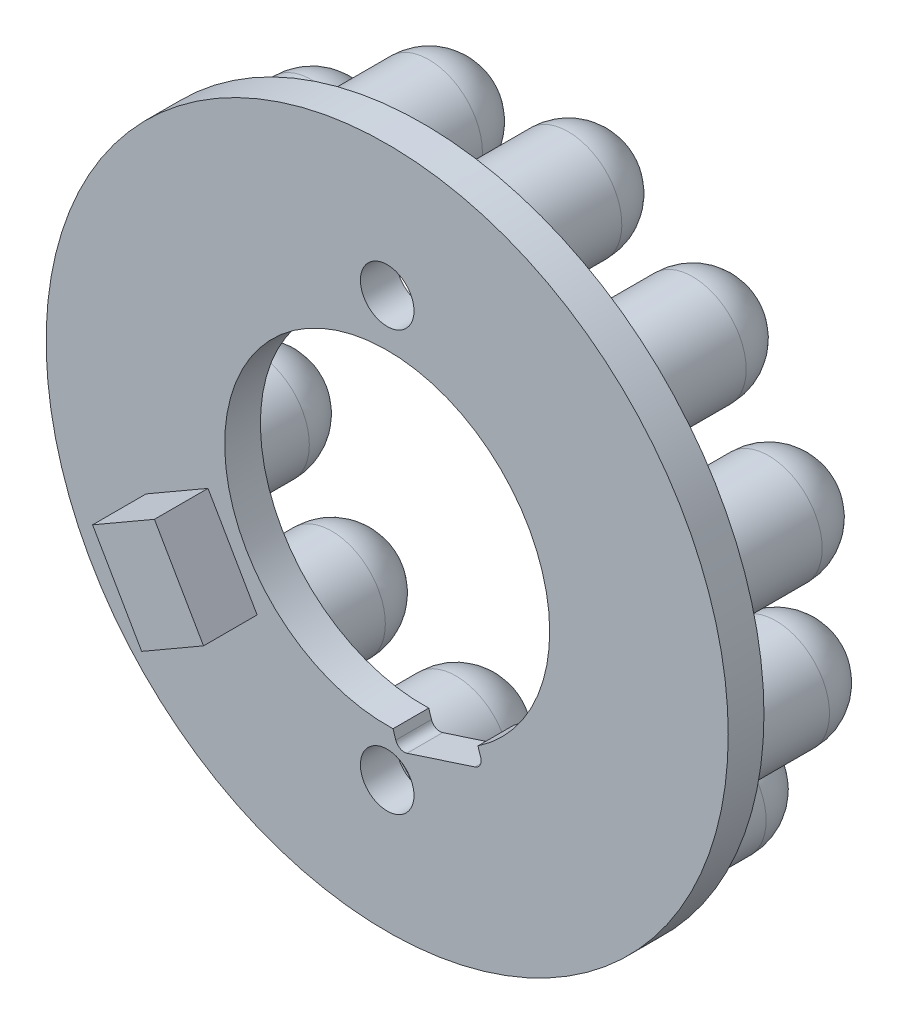
ISO-10303-21;
HEADER;
FILE_DESCRIPTION(('STEP AP214'),'2;1');
FILE_NAME('part.step','',(''),(''),'','','');
FILE_SCHEMA(('AUTOMOTIVE_DESIGN { 1 0 10303 214 1 1 1 1 }'));
ENDSEC;
DATA;
#1=APPLICATION_CONTEXT('core data for automotive mechanical design processes');
#2=APPLICATION_PROTOCOL_DEFINITION('international standard','automotive_design',2000,#1);
#3=PRODUCT_CONTEXT('',#1,'mechanical');
#4=PRODUCT('Part','Part','',(#3));
#5=PRODUCT_RELATED_PRODUCT_CATEGORY('part','',(#4));
#6=PRODUCT_DEFINITION_FORMATION('','',#4);
#7=PRODUCT_DEFINITION_CONTEXT('part definition',#1,'design');
#8=PRODUCT_DEFINITION('design','',#6,#7);
#9=PRODUCT_DEFINITION_SHAPE('','',#8);
#10=(LENGTH_UNIT() NAMED_UNIT(*) SI_UNIT(.MILLI.,.METRE.));
#11=(NAMED_UNIT(*) PLANE_ANGLE_UNIT() SI_UNIT($,.RADIAN.));
#12=(NAMED_UNIT(*) SI_UNIT($,.STERADIAN.) SOLID_ANGLE_UNIT());
#13=UNCERTAINTY_MEASURE_WITH_UNIT(LENGTH_MEASURE(1.E-05),#10,'distance_accuracy_value','');
#14=(GEOMETRIC_REPRESENTATION_CONTEXT(3) GLOBAL_UNCERTAINTY_ASSIGNED_CONTEXT((#13)) GLOBAL_UNIT_ASSIGNED_CONTEXT((#10,
#11,#12)) REPRESENTATION_CONTEXT('',''));
#15=CARTESIAN_POINT('',(0.,0.,0.));
#16=DIRECTION('',(0.,0.,1.));
#17=DIRECTION('',(1.,0.,0.));
#18=AXIS2_PLACEMENT_3D('',#15,#16,#17);
#19=CARTESIAN_POINT('',(0.,0.,2.));
#20=DIRECTION('',(0.,0.,1.));
#21=DIRECTION('',(1.,0.,0.));
#22=AXIS2_PLACEMENT_3D('',#19,#20,#21);
#23=PLANE('',#22);
#24=CARTESIAN_POINT('',(0.,11.75,2.));
#25=DIRECTION('',(0.,0.,1.));
#26=DIRECTION('',(1.,0.,0.));
#27=AXIS2_PLACEMENT_3D('',#24,#25,#26);
#28=CIRCLE('',#27,1.5);
#29=CARTESIAN_POINT('',(1.5,11.75,2.));
#30=VERTEX_POINT('',#29);
#31=EDGE_CURVE('E237',#30,#30,#28,.T.);
#32=ORIENTED_EDGE('',*,*,#31,.F.);
#33=EDGE_LOOP('',(#32));
#34=FACE_BOUND('',#33,.T.);
#35=CARTESIAN_POINT('',(0.,-11.75,2.));
#36=DIRECTION('',(0.,0.,1.));
#37=DIRECTION('',(1.,0.,0.));
#38=AXIS2_PLACEMENT_3D('',#35,#36,#37);
#39=CIRCLE('',#38,1.5);
#40=CARTESIAN_POINT('',(1.5,-11.75,2.));
#41=VERTEX_POINT('',#40);
#42=EDGE_CURVE('E241',#41,#41,#39,.T.);
#43=ORIENTED_EDGE('',*,*,#42,.F.);
#44=EDGE_LOOP('',(#43));
#45=FACE_BOUND('',#44,.T.);
#46=CARTESIAN_POINT('',(0.,0.,2.));
#47=DIRECTION('',(0.,0.,1.));
#48=DIRECTION('',(1.,0.,0.));
#49=AXIS2_PLACEMENT_3D('',#46,#47,#48);
#50=CIRCLE('',#49,9.1);
#51=CARTESIAN_POINT('',(5.08149584587334,-7.54906616531952,2.));
#52=VERTEX_POINT('',#51);
#53=CARTESIAN_POINT('',(0.326213264397566,-9.09415113719423,2.));
#54=VERTEX_POINT('',#53);
#55=EDGE_CURVE('E246',#52,#54,#50,.T.);
#56=ORIENTED_EDGE('',*,*,#55,.F.);
#57=DIRECTION('',(-0.309016994374942,0.951056516295156,0.));
#58=VECTOR('',#57,1.);
#59=CARTESIAN_POINT('',(2.37764129073789,0.772542485937354,2.));
#60=LINE('',#59,#58);
#61=CARTESIAN_POINT('',(5.23600434306081,-8.0245944234671,2.));
#62=VERTEX_POINT('',#61);
#63=EDGE_CURVE('E250',#62,#52,#60,.T.);
#64=ORIENTED_EDGE('',*,*,#63,.F.);
#65=CARTESIAN_POINT('',(4.76047608491323,-8.17910292065457,2.));
#66=DIRECTION('',(0.,0.,1.));
#67=DIRECTION('',(1.,0.,0.));
#68=AXIS2_PLACEMENT_3D('',#65,#66,#67);
#69=CIRCLE('',#68,0.5);
#70=CARTESIAN_POINT('',(4.9149845821007,-8.65463117880214,2.));
#71=VERTEX_POINT('',#70);
#72=EDGE_CURVE('E317',#62,#71,#69,.F.);
#73=ORIENTED_EDGE('',*,*,#72,.T.);
#74=DIRECTION('',(0.951056516295155,0.309016994374942,0.));
#75=VECTOR('',#74,1.);
#76=CARTESIAN_POINT('',(3.01287154951039,-9.27266516755203,2.));
#77=LINE('',#76,#75);
#78=CARTESIAN_POINT('',(1.11075851692008,-9.89069915630191,2.));
#79=VERTEX_POINT('',#78);
#80=EDGE_CURVE('E253',#79,#71,#77,.T.);
#81=ORIENTED_EDGE('',*,*,#80,.F.);
#82=CARTESIAN_POINT('',(0.956250019732613,-9.41517089815433,2.));
#83=DIRECTION('',(0.,0.,1.));
#84=DIRECTION('',(1.,0.,0.));
#85=AXIS2_PLACEMENT_3D('',#82,#83,#84);
#86=CIRCLE('',#85,0.5);
#87=CARTESIAN_POINT('',(0.480721761585035,-9.5696793953418,2.));
#88=VERTEX_POINT('',#87);
#89=EDGE_CURVE('E311',#79,#88,#86,.F.);
#90=ORIENTED_EDGE('',*,*,#89,.T.);
#91=DIRECTION('',(0.309016994374942,-0.951056516295155,0.));
#92=VECTOR('',#91,1.);
#93=CARTESIAN_POINT('',(-2.37764129073789,-0.772542485937354,2.));
#94=LINE('',#93,#92);
#95=EDGE_CURVE('E257',#54,#88,#94,.T.);
#96=ORIENTED_EDGE('',*,*,#95,.F.);
#97=EDGE_LOOP('',(#56,#64,#73,#81,#90,#96));
#98=FACE_BOUND('',#97,.T.);
#99=CARTESIAN_POINT('',(0.,0.,2.));
#100=DIRECTION('',(0.,0.,1.));
#101=DIRECTION('',(1.,0.,0.));
#102=AXIS2_PLACEMENT_3D('',#99,#100,#101);
#103=CIRCLE('',#102,19.1);
#104=CARTESIAN_POINT('',(19.1,0.,2.));
#105=VERTEX_POINT('',#104);
#106=EDGE_CURVE('E261',#105,#105,#103,.T.);
#107=ORIENTED_EDGE('',*,*,#106,.T.);
#108=EDGE_LOOP('',(#107));
#109=FACE_BOUND('',#108,.T.);
#110=DIRECTION('',(-0.866025403784435,-0.500000000000006,0.));
#111=VECTOR('',#110,1.);
#112=CARTESIAN_POINT('',(-10.0352540378444,-2.61843013959284,2.));
#113=LINE('',#112,#111);
#114=CARTESIAN_POINT('',(-10.0352540378444,-2.61843013959284,2.));
#115=VERTEX_POINT('',#114);
#116=CARTESIAN_POINT('',(-13.4993556529821,-4.61843013959287,2.));
#117=VERTEX_POINT('',#116);
#118=EDGE_CURVE('E216',#115,#117,#113,.T.);
#119=ORIENTED_EDGE('',*,*,#118,.F.);
#120=DIRECTION('',(-0.500000000000004,0.866025403784436,0.));
#121=VECTOR('',#120,1.);
#122=CARTESIAN_POINT('',(-7.28525403784435,-7.38156986040724,2.));
#123=LINE('',#122,#121);
#124=CARTESIAN_POINT('',(-7.28525403784435,-7.38156986040724,2.));
#125=VERTEX_POINT('',#124);
#126=EDGE_CURVE('E197',#125,#115,#123,.T.);
#127=ORIENTED_EDGE('',*,*,#126,.F.);
#128=DIRECTION('',(0.866025403784435,0.500000000000006,0.));
#129=VECTOR('',#128,1.);
#130=CARTESIAN_POINT('',(-10.7493556529821,-9.38156986040727,2.));
#131=LINE('',#130,#129);
#132=CARTESIAN_POINT('',(-10.7493556529821,-9.38156986040727,2.));
#133=VERTEX_POINT('',#132);
#134=EDGE_CURVE('E203',#133,#125,#131,.T.);
#135=ORIENTED_EDGE('',*,*,#134,.F.);
#136=DIRECTION('',(0.500000000000004,-0.866025403784436,0.));
#137=VECTOR('',#136,1.);
#138=CARTESIAN_POINT('',(-13.4993556529821,-4.61843013959287,2.));
#139=LINE('',#138,#137);
#140=EDGE_CURVE('E219',#117,#133,#139,.T.);
#141=ORIENTED_EDGE('',*,*,#140,.F.);
#142=EDGE_LOOP('',(#119,#127,#135,#141));
#143=FACE_BOUND('',#142,.T.);
#144=ADVANCED_FACE('F41',(#34,#45,#98,#109,#143),#23,.T.);
#145=CARTESIAN_POINT('',(0.,0.,2.));
#146=DIRECTION('',(0.,0.,-1.));
#147=DIRECTION('',(-1.,0.,0.));
#148=AXIS2_PLACEMENT_3D('',#145,#146,#147);
#149=CYLINDRICAL_SURFACE('',#148,9.1);
#150=CARTESIAN_POINT('',(0.,0.,0.));
#151=DIRECTION('',(0.,0.,1.));
#152=DIRECTION('',(1.,0.,0.));
#153=AXIS2_PLACEMENT_3D('',#150,#151,#152);
#154=CIRCLE('',#153,9.1);
#155=CARTESIAN_POINT('',(5.08149584587334,-7.54906616531952,0.));
#156=VERTEX_POINT('',#155);
#157=CARTESIAN_POINT('',(0.326213264397566,-9.09415113719423,0.));
#158=VERTEX_POINT('',#157);
#159=EDGE_CURVE('E270',#156,#158,#154,.T.);
#160=ORIENTED_EDGE('',*,*,#159,.F.);
#161=DIRECTION('',(0.,0.,-1.));
#162=VECTOR('',#161,1.);
#163=CARTESIAN_POINT('',(5.08149584587334,-7.54906616531952,2.));
#164=LINE('',#163,#162);
#165=EDGE_CURVE('E290',#52,#156,#164,.T.);
#166=ORIENTED_EDGE('',*,*,#165,.F.);
#167=ORIENTED_EDGE('',*,*,#55,.T.);
#168=DIRECTION('',(0.,0.,-1.));
#169=VECTOR('',#168,1.);
#170=CARTESIAN_POINT('',(0.326213264397566,-9.09415113719423,2.));
#171=LINE('',#170,#169);
#172=EDGE_CURVE('E264',#54,#158,#171,.T.);
#173=ORIENTED_EDGE('',*,*,#172,.T.);
#174=EDGE_LOOP('',(#160,#166,#167,#173));
#175=FACE_BOUND('',#174,.T.);
#176=ADVANCED_FACE('F383',(#175),#149,.F.);
#177=CARTESIAN_POINT('',(2.37764129073789,0.772542485937354,2.));
#178=DIRECTION('',(-0.951056516295156,-0.309016994374942,0.));
#179=DIRECTION('',(0.309016994374942,-0.951056516295156,0.));
#180=AXIS2_PLACEMENT_3D('',#177,#178,#179);
#181=PLANE('',#180);
#182=DIRECTION('',(-0.309016994374942,0.951056516295156,0.));
#183=VECTOR('',#182,1.);
#184=CARTESIAN_POINT('',(2.37764129073789,0.772542485937354,0.));
#185=LINE('',#184,#183);
#186=CARTESIAN_POINT('',(5.23600434306081,-8.0245944234671,0.));
#187=VERTEX_POINT('',#186);
#188=EDGE_CURVE('E274',#187,#156,#185,.T.);
#189=ORIENTED_EDGE('',*,*,#188,.F.);
#190=DIRECTION('',(0.,0.,-1.));
#191=VECTOR('',#190,1.);
#192=CARTESIAN_POINT('',(5.23600434306081,-8.0245944234671,2.));
#193=LINE('',#192,#191);
#194=EDGE_CURVE('E305',#187,#62,#193,.F.);
#195=ORIENTED_EDGE('',*,*,#194,.T.);
#196=ORIENTED_EDGE('',*,*,#63,.T.);
#197=ORIENTED_EDGE('',*,*,#165,.T.);
#198=EDGE_LOOP('',(#189,#195,#196,#197));
#199=FACE_BOUND('',#198,.T.);
#200=ADVANCED_FACE('F389',(#199),#181,.T.);
#201=CARTESIAN_POINT('',(3.01287154951039,-9.27266516755203,2.));
#202=DIRECTION('',(-0.309016994374942,0.951056516295155,0.));
#203=DIRECTION('',(-0.951056516295155,-0.309016994374942,0.));
#204=AXIS2_PLACEMENT_3D('',#201,#202,#203);
#205=PLANE('',#204);
#206=DIRECTION('',(0.951056516295155,0.309016994374942,0.));
#207=VECTOR('',#206,1.);
#208=CARTESIAN_POINT('',(3.01287154951039,-9.27266516755203,0.));
#209=LINE('',#208,#207);
#210=CARTESIAN_POINT('',(1.11075851692008,-9.89069915630191,0.));
#211=VERTEX_POINT('',#210);
#212=CARTESIAN_POINT('',(4.9149845821007,-8.65463117880214,0.));
#213=VERTEX_POINT('',#212);
#214=EDGE_CURVE('E277',#211,#213,#209,.T.);
#215=ORIENTED_EDGE('',*,*,#214,.F.);
#216=DIRECTION('',(0.,0.,-1.));
#217=VECTOR('',#216,1.);
#218=CARTESIAN_POINT('',(1.11075851692008,-9.89069915630191,2.));
#219=LINE('',#218,#217);
#220=EDGE_CURVE('E302',#211,#79,#219,.F.);
#221=ORIENTED_EDGE('',*,*,#220,.T.);
#222=ORIENTED_EDGE('',*,*,#80,.T.);
#223=DIRECTION('',(0.,0.,-1.));
#224=VECTOR('',#223,1.);
#225=CARTESIAN_POINT('',(4.9149845821007,-8.65463117880214,0.));
#226=LINE('',#225,#224);
#227=EDGE_CURVE('E298',#71,#213,#226,.T.);
#228=ORIENTED_EDGE('',*,*,#227,.T.);
#229=EDGE_LOOP('',(#215,#221,#222,#228));
#230=FACE_BOUND('',#229,.T.);
#231=ADVANCED_FACE('F405',(#230),#205,.T.);
#232=CARTESIAN_POINT('',(-2.37764129073789,-0.772542485937354,2.));
#233=DIRECTION('',(0.951056516295155,0.309016994374942,0.));
#234=DIRECTION('',(-0.309016994374942,0.951056516295155,0.));
#235=AXIS2_PLACEMENT_3D('',#232,#233,#234);
#236=PLANE('',#235);
#237=ORIENTED_EDGE('',*,*,#95,.T.);
#238=DIRECTION('',(0.,0.,-1.));
#239=VECTOR('',#238,1.);
#240=CARTESIAN_POINT('',(0.480721761585035,-9.5696793953418,0.));
#241=LINE('',#240,#239);
#242=CARTESIAN_POINT('',(0.480721761585035,-9.5696793953418,0.));
#243=VERTEX_POINT('',#242);
#244=EDGE_CURVE('E294',#88,#243,#241,.T.);
#245=ORIENTED_EDGE('',*,*,#244,.T.);
#246=DIRECTION('',(0.309016994374942,-0.951056516295155,0.));
#247=VECTOR('',#246,1.);
#248=CARTESIAN_POINT('',(-2.37764129073789,-0.772542485937354,0.));
#249=LINE('',#248,#247);
#250=EDGE_CURVE('E281',#158,#243,#249,.T.);
#251=ORIENTED_EDGE('',*,*,#250,.F.);
#252=ORIENTED_EDGE('',*,*,#172,.F.);
#253=EDGE_LOOP('',(#237,#245,#251,#252));
#254=FACE_BOUND('',#253,.T.);
#255=ADVANCED_FACE('F401',(#254),#236,.T.);
#256=CARTESIAN_POINT('',(0.,-11.75,2.));
#257=DIRECTION('',(0.,0.,-1.));
#258=DIRECTION('',(-1.,0.,0.));
#259=AXIS2_PLACEMENT_3D('',#256,#257,#258);
#260=CYLINDRICAL_SURFACE('',#259,1.5);
#261=ORIENTED_EDGE('',*,*,#42,.T.);
#262=EDGE_LOOP('',(#261));
#263=FACE_BOUND('',#262,.T.);
#264=CARTESIAN_POINT('',(0.,-11.75,0.));
#265=DIRECTION('',(0.,0.,1.));
#266=DIRECTION('',(1.,0.,0.));
#267=AXIS2_PLACEMENT_3D('',#264,#265,#266);
#268=CIRCLE('',#267,1.5);
#269=CARTESIAN_POINT('',(-1.37858875904972,-12.3411793580816,0.));
#270=VERTEX_POINT('',#269);
#271=CARTESIAN_POINT('',(-0.644178833580429,-13.1046341315525,0.));
#272=VERTEX_POINT('',#271);
#273=EDGE_CURVE('E266',#270,#272,#268,.T.);
#274=ORIENTED_EDGE('',*,*,#273,.F.);
#275=EDGE_CURVE('E139',#272,#270,#268,.T.);
#276=ORIENTED_EDGE('',*,*,#275,.F.);
#277=EDGE_LOOP('',(#274,#276));
#278=FACE_BOUND('',#277,.T.);
#279=ADVANCED_FACE('F404',(#263,#278),#260,.F.);
#280=CARTESIAN_POINT('',(0.,11.75,2.));
#281=DIRECTION('',(0.,0.,-1.));
#282=DIRECTION('',(-1.,0.,0.));
#283=AXIS2_PLACEMENT_3D('',#280,#281,#282);
#284=CYLINDRICAL_SURFACE('',#283,1.5);
#285=ORIENTED_EDGE('',*,*,#31,.T.);
#286=EDGE_LOOP('',(#285));
#287=FACE_BOUND('',#286,.T.);
#288=CARTESIAN_POINT('',(0.,11.75,0.));
#289=DIRECTION('',(0.,0.,1.));
#290=DIRECTION('',(1.,0.,0.));
#291=AXIS2_PLACEMENT_3D('',#288,#289,#290);
#292=CIRCLE('',#291,1.5);
#293=CARTESIAN_POINT('',(1.37858875904968,12.3411793580817,0.));
#294=VERTEX_POINT('',#293);
#295=CARTESIAN_POINT('',(0.644178833580563,13.1046341315524,0.));
#296=VERTEX_POINT('',#295);
#297=EDGE_CURVE('E132',#294,#296,#292,.T.);
#298=ORIENTED_EDGE('',*,*,#297,.F.);
#299=EDGE_CURVE('E134',#296,#294,#292,.T.);
#300=ORIENTED_EDGE('',*,*,#299,.F.);
#301=EDGE_LOOP('',(#298,#300));
#302=FACE_BOUND('',#301,.T.);
#303=ADVANCED_FACE('F133',(#287,#302),#284,.F.);
#304=CARTESIAN_POINT('',(0.,0.,2.));
#305=DIRECTION('',(0.,0.,-1.));
#306=DIRECTION('',(-1.,0.,0.));
#307=AXIS2_PLACEMENT_3D('',#304,#305,#306);
#308=CYLINDRICAL_SURFACE('',#307,19.1);
#309=ORIENTED_EDGE('',*,*,#106,.F.);
#310=EDGE_LOOP('',(#309));
#311=FACE_BOUND('',#310,.T.);
#312=CARTESIAN_POINT('',(0.,0.,0.));
#313=DIRECTION('',(0.,0.,1.));
#314=DIRECTION('',(1.,0.,0.));
#315=AXIS2_PLACEMENT_3D('',#312,#313,#314);
#316=CIRCLE('',#315,19.1);
#317=CARTESIAN_POINT('',(19.1,0.,0.));
#318=VERTEX_POINT('',#317);
#319=EDGE_CURVE('E242',#318,#318,#316,.T.);
#320=ORIENTED_EDGE('',*,*,#319,.T.);
#321=EDGE_LOOP('',(#320));
#322=FACE_BOUND('',#321,.T.);
#323=ADVANCED_FACE('F360',(#311,#322),#308,.T.);
#324=CARTESIAN_POINT('',(0.,0.,0.));
#325=DIRECTION('',(0.,0.,1.));
#326=DIRECTION('',(1.,0.,0.));
#327=AXIS2_PLACEMENT_3D('',#324,#325,#326);
#328=PLANE('',#327);
#329=CARTESIAN_POINT('',(11.2214868647085,-10.103872156019,0.));
#330=DIRECTION('',(0.,0.,1.));
#331=DIRECTION('',(1.,0.,0.));
#332=AXIS2_PLACEMENT_3D('',#329,#330,#331);
#333=CIRCLE('',#332,3.);
#334=CARTESIAN_POINT('',(14.2214868647085,-10.103872156019,0.));
#335=VERTEX_POINT('',#334);
#336=EDGE_CURVE('E11',#335,#335,#333,.F.);
#337=ORIENTED_EDGE('',*,*,#336,.F.);
#338=EDGE_LOOP('',(#337));
#339=FACE_BOUND('',#338,.T.);
#340=CARTESIAN_POINT('',(14.7700287710804,-3.13946653134843,0.));
#341=DIRECTION('',(0.,0.,1.));
#342=DIRECTION('',(1.,0.,0.));
#343=AXIS2_PLACEMENT_3D('',#340,#341,#342);
#344=CIRCLE('',#343,3.);
#345=CARTESIAN_POINT('',(17.7700287710804,-3.13946653134843,0.));
#346=VERTEX_POINT('',#345);
#347=EDGE_CURVE('E50',#346,#346,#344,.F.);
#348=ORIENTED_EDGE('',*,*,#347,.F.);
#349=EDGE_LOOP('',(#348));
#350=FACE_BOUND('',#349,.T.);
#351=CARTESIAN_POINT('',(14.3609533960569,4.66615661506147,0.));
#352=DIRECTION('',(0.,0.,1.));
#353=DIRECTION('',(1.,0.,0.));
#354=AXIS2_PLACEMENT_3D('',#351,#352,#353);
#355=CIRCLE('',#354,3.);
#356=CARTESIAN_POINT('',(17.3609533960569,4.66615661506147,0.));
#357=VERTEX_POINT('',#356);
#358=EDGE_CURVE('E348',#357,#357,#355,.F.);
#359=ORIENTED_EDGE('',*,*,#358,.F.);
#360=EDGE_LOOP('',(#359));
#361=FACE_BOUND('',#360,.T.);
#362=CARTESIAN_POINT('',(10.1038721560189,11.2214868647085,0.));
#363=DIRECTION('',(0.,0.,1.));
#364=DIRECTION('',(1.,0.,0.));
#365=AXIS2_PLACEMENT_3D('',#362,#363,#364);
#366=CIRCLE('',#365,3.);
#367=CARTESIAN_POINT('',(13.1038721560189,11.2214868647085,0.));
#368=VERTEX_POINT('',#367);
#369=EDGE_CURVE('E149',#368,#368,#366,.F.);
#370=ORIENTED_EDGE('',*,*,#369,.F.);
#371=EDGE_LOOP('',(#370));
#372=FACE_BOUND('',#371,.T.);
#373=CARTESIAN_POINT('',(3.13946653134838,14.7700287710804,0.));
#374=DIRECTION('',(0.,0.,1.));
#375=DIRECTION('',(1.,0.,0.));
#376=AXIS2_PLACEMENT_3D('',#373,#374,#375);
#377=CIRCLE('',#376,3.);
#378=EDGE_CURVE('E56',#296,#294,#377,.F.);
#379=ORIENTED_EDGE('',*,*,#378,.F.);
#380=ORIENTED_EDGE('',*,*,#299,.T.);
#381=EDGE_LOOP('',(#379,#380));
#382=FACE_BOUND('',#381,.T.);
#383=CARTESIAN_POINT('',(-4.66615661506162,14.3609533960568,0.));
#384=DIRECTION('',(0.,0.,1.));
#385=DIRECTION('',(1.,0.,0.));
#386=AXIS2_PLACEMENT_3D('',#383,#384,#385);
#387=CIRCLE('',#386,3.);
#388=CARTESIAN_POINT('',(-1.66615661506162,14.3609533960568,0.));
#389=VERTEX_POINT('',#388);
#390=EDGE_CURVE('E150',#389,#389,#387,.F.);
#391=ORIENTED_EDGE('',*,*,#390,.F.);
#392=EDGE_LOOP('',(#391));
#393=FACE_BOUND('',#392,.T.);
#394=CARTESIAN_POINT('',(-11.2214868647085,10.1038721560189,0.));
#395=DIRECTION('',(0.,0.,1.));
#396=DIRECTION('',(1.,0.,0.));
#397=AXIS2_PLACEMENT_3D('',#394,#395,#396);
#398=CIRCLE('',#397,3.);
#399=CARTESIAN_POINT('',(-8.22148686470853,10.1038721560189,0.));
#400=VERTEX_POINT('',#399);
#401=EDGE_CURVE('E338',#400,#400,#398,.F.);
#402=ORIENTED_EDGE('',*,*,#401,.F.);
#403=EDGE_LOOP('',(#402));
#404=FACE_BOUND('',#403,.T.);
#405=CARTESIAN_POINT('',(-14.7700287710804,3.13946653134832,0.));
#406=DIRECTION('',(0.,0.,1.));
#407=DIRECTION('',(1.,0.,0.));
#408=AXIS2_PLACEMENT_3D('',#405,#406,#407);
#409=CIRCLE('',#408,3.);
#410=CARTESIAN_POINT('',(-11.7700287710804,3.13946653134832,0.));
#411=VERTEX_POINT('',#410);
#412=EDGE_CURVE('E334',#411,#411,#409,.F.);
#413=ORIENTED_EDGE('',*,*,#412,.F.);
#414=EDGE_LOOP('',(#413));
#415=FACE_BOUND('',#414,.T.);
#416=CARTESIAN_POINT('',(-14.3609533960569,-4.66615661506157,0.));
#417=DIRECTION('',(0.,0.,1.));
#418=DIRECTION('',(1.,0.,0.));
#419=AXIS2_PLACEMENT_3D('',#416,#417,#418);
#420=CIRCLE('',#419,3.);
#421=CARTESIAN_POINT('',(-11.3609533960569,-4.66615661506157,0.));
#422=VERTEX_POINT('',#421);
#423=EDGE_CURVE('E330',#422,#422,#420,.F.);
#424=ORIENTED_EDGE('',*,*,#423,.F.);
#425=EDGE_LOOP('',(#424));
#426=FACE_BOUND('',#425,.T.);
#427=CARTESIAN_POINT('',(-10.1038721560189,-11.2214868647086,0.));
#428=DIRECTION('',(0.,0.,1.));
#429=DIRECTION('',(1.,0.,0.));
#430=AXIS2_PLACEMENT_3D('',#427,#428,#429);
#431=CIRCLE('',#430,3.);
#432=CARTESIAN_POINT('',(-7.10387215601885,-11.2214868647086,0.));
#433=VERTEX_POINT('',#432);
#434=EDGE_CURVE('E326',#433,#433,#431,.F.);
#435=ORIENTED_EDGE('',*,*,#434,.F.);
#436=EDGE_LOOP('',(#435));
#437=FACE_BOUND('',#436,.T.);
#438=CARTESIAN_POINT('',(-3.13946653134827,-14.7700287710804,0.));
#439=DIRECTION('',(0.,0.,1.));
#440=DIRECTION('',(1.,0.,0.));
#441=AXIS2_PLACEMENT_3D('',#438,#439,#440);
#442=CIRCLE('',#441,3.);
#443=EDGE_CURVE('E63',#272,#270,#442,.F.);
#444=ORIENTED_EDGE('',*,*,#443,.F.);
#445=ORIENTED_EDGE('',*,*,#275,.T.);
#446=EDGE_LOOP('',(#444,#445));
#447=FACE_BOUND('',#446,.T.);
#448=CARTESIAN_POINT('',(4.66615661506162,-14.3609533960568,0.));
#449=DIRECTION('',(0.,0.,1.));
#450=DIRECTION('',(1.,0.,0.));
#451=AXIS2_PLACEMENT_3D('',#448,#449,#450);
#452=CIRCLE('',#451,3.);
#453=CARTESIAN_POINT('',(7.66615661506162,-14.3609533960568,0.));
#454=VERTEX_POINT('',#453);
#455=EDGE_CURVE('E320',#454,#454,#452,.F.);
#456=ORIENTED_EDGE('',*,*,#455,.F.);
#457=EDGE_LOOP('',(#456));
#458=FACE_BOUND('',#457,.T.);
#459=ORIENTED_EDGE('',*,*,#159,.T.);
#460=ORIENTED_EDGE('',*,*,#250,.T.);
#461=CARTESIAN_POINT('',(0.956250019732613,-9.41517089815433,0.));
#462=DIRECTION('',(0.,0.,1.));
#463=DIRECTION('',(1.,0.,0.));
#464=AXIS2_PLACEMENT_3D('',#461,#462,#463);
#465=CIRCLE('',#464,0.5);
#466=EDGE_CURVE('E308',#243,#211,#465,.T.);
#467=ORIENTED_EDGE('',*,*,#466,.T.);
#468=ORIENTED_EDGE('',*,*,#214,.T.);
#469=CARTESIAN_POINT('',(4.76047608491323,-8.17910292065457,0.));
#470=DIRECTION('',(0.,0.,1.));
#471=DIRECTION('',(1.,0.,0.));
#472=AXIS2_PLACEMENT_3D('',#469,#470,#471);
#473=CIRCLE('',#472,0.5);
#474=EDGE_CURVE('E314',#213,#187,#473,.T.);
#475=ORIENTED_EDGE('',*,*,#474,.T.);
#476=ORIENTED_EDGE('',*,*,#188,.T.);
#477=EDGE_LOOP('',(#459,#460,#467,#468,#475,#476));
#478=FACE_BOUND('',#477,.T.);
#479=ORIENTED_EDGE('',*,*,#319,.F.);
#480=EDGE_LOOP('',(#479));
#481=FACE_BOUND('',#480,.T.);
#482=ADVANCED_FACE('F141',(#339,#350,#361,#372,#382,#393,#404,#415,#426,#437,#447,#458,#478,
#481),#328,.F.);
#483=CARTESIAN_POINT('',(0.956250019732613,-9.41517089815433,2.));
#484=DIRECTION('',(0.,0.,1.));
#485=DIRECTION('',(1.,0.,0.));
#486=AXIS2_PLACEMENT_3D('',#483,#484,#485);
#487=CYLINDRICAL_SURFACE('',#486,0.5);
#488=ORIENTED_EDGE('',*,*,#89,.F.);
#489=ORIENTED_EDGE('',*,*,#220,.F.);
#490=ORIENTED_EDGE('',*,*,#466,.F.);
#491=ORIENTED_EDGE('',*,*,#244,.F.);
#492=EDGE_LOOP('',(#488,#489,#490,#491));
#493=FACE_BOUND('',#492,.T.);
#494=ADVANCED_FACE('F359',(#493),#487,.F.);
#495=CARTESIAN_POINT('',(4.76047608491323,-8.17910292065457,2.));
#496=DIRECTION('',(0.,0.,1.));
#497=DIRECTION('',(1.,0.,0.));
#498=AXIS2_PLACEMENT_3D('',#495,#496,#497);
#499=CYLINDRICAL_SURFACE('',#498,0.5);
#500=ORIENTED_EDGE('',*,*,#72,.F.);
#501=ORIENTED_EDGE('',*,*,#194,.F.);
#502=ORIENTED_EDGE('',*,*,#474,.F.);
#503=ORIENTED_EDGE('',*,*,#227,.F.);
#504=EDGE_LOOP('',(#500,#501,#502,#503));
#505=FACE_BOUND('',#504,.T.);
#506=ADVANCED_FACE('F43',(#505),#499,.F.);
#507=CARTESIAN_POINT('',(-7.28525403784435,-7.38156986040724,5.));
#508=DIRECTION('',(-0.866025403784436,-0.500000000000004,0.));
#509=DIRECTION('',(0.500000000000004,-0.866025403784436,0.));
#510=AXIS2_PLACEMENT_3D('',#507,#508,#509);
#511=PLANE('',#510);
#512=ORIENTED_EDGE('',*,*,#126,.T.);
#513=DIRECTION('',(0.,0.,-1.));
#514=VECTOR('',#513,1.);
#515=CARTESIAN_POINT('',(-10.0352540378444,-2.61843013959284,5.));
#516=LINE('',#515,#514);
#517=CARTESIAN_POINT('',(-10.0352540378444,-2.61843013959284,5.));
#518=VERTEX_POINT('',#517);
#519=EDGE_CURVE('E144',#518,#115,#516,.T.);
#520=ORIENTED_EDGE('',*,*,#519,.F.);
#521=DIRECTION('',(-0.500000000000004,0.866025403784436,0.));
#522=VECTOR('',#521,1.);
#523=CARTESIAN_POINT('',(-7.28525403784435,-7.38156986040724,5.));
#524=LINE('',#523,#522);
#525=CARTESIAN_POINT('',(-7.28525403784435,-7.38156986040724,5.));
#526=VERTEX_POINT('',#525);
#527=EDGE_CURVE('E198',#526,#518,#524,.T.);
#528=ORIENTED_EDGE('',*,*,#527,.F.);
#529=DIRECTION('',(0.,0.,-1.));
#530=VECTOR('',#529,1.);
#531=CARTESIAN_POINT('',(-7.28525403784435,-7.38156986040724,5.));
#532=LINE('',#531,#530);
#533=EDGE_CURVE('E212',#526,#125,#532,.T.);
#534=ORIENTED_EDGE('',*,*,#533,.T.);
#535=EDGE_LOOP('',(#512,#520,#528,#534));
#536=FACE_BOUND('',#535,.T.);
#537=ADVANCED_FACE('F395',(#536),#511,.F.);
#538=CARTESIAN_POINT('',(-10.0352540378444,-2.61843013959284,5.));
#539=DIRECTION('',(0.500000000000006,-0.866025403784435,0.));
#540=DIRECTION('',(0.866025403784435,0.500000000000006,0.));
#541=AXIS2_PLACEMENT_3D('',#538,#539,#540);
#542=PLANE('',#541);
#543=ORIENTED_EDGE('',*,*,#118,.T.);
#544=DIRECTION('',(0.,0.,-1.));
#545=VECTOR('',#544,1.);
#546=CARTESIAN_POINT('',(-13.4993556529821,-4.61843013959287,5.));
#547=LINE('',#546,#545);
#548=CARTESIAN_POINT('',(-13.4993556529821,-4.61843013959287,5.));
#549=VERTEX_POINT('',#548);
#550=EDGE_CURVE('E231',#549,#117,#547,.T.);
#551=ORIENTED_EDGE('',*,*,#550,.F.);
#552=DIRECTION('',(-0.866025403784435,-0.500000000000006,0.));
#553=VECTOR('',#552,1.);
#554=CARTESIAN_POINT('',(-10.0352540378444,-2.61843013959284,5.));
#555=LINE('',#554,#553);
#556=EDGE_CURVE('E202',#518,#549,#555,.T.);
#557=ORIENTED_EDGE('',*,*,#556,.F.);
#558=ORIENTED_EDGE('',*,*,#519,.T.);
#559=EDGE_LOOP('',(#543,#551,#557,#558));
#560=FACE_BOUND('',#559,.T.);
#561=ADVANCED_FACE('F453',(#560),#542,.F.);
#562=CARTESIAN_POINT('',(-13.4993556529821,-4.61843013959287,5.));
#563=DIRECTION('',(0.866025403784436,0.500000000000004,0.));
#564=DIRECTION('',(-0.500000000000004,0.866025403784436,0.));
#565=AXIS2_PLACEMENT_3D('',#562,#563,#564);
#566=PLANE('',#565);
#567=ORIENTED_EDGE('',*,*,#140,.T.);
#568=DIRECTION('',(0.,0.,-1.));
#569=VECTOR('',#568,1.);
#570=CARTESIAN_POINT('',(-10.7493556529821,-9.38156986040727,5.));
#571=LINE('',#570,#569);
#572=CARTESIAN_POINT('',(-10.7493556529821,-9.38156986040727,5.));
#573=VERTEX_POINT('',#572);
#574=EDGE_CURVE('E228',#573,#133,#571,.T.);
#575=ORIENTED_EDGE('',*,*,#574,.F.);
#576=DIRECTION('',(0.500000000000004,-0.866025403784436,0.));
#577=VECTOR('',#576,1.);
#578=CARTESIAN_POINT('',(-13.4993556529821,-4.61843013959287,5.));
#579=LINE('',#578,#577);
#580=EDGE_CURVE('E206',#549,#573,#579,.T.);
#581=ORIENTED_EDGE('',*,*,#580,.F.);
#582=ORIENTED_EDGE('',*,*,#550,.T.);
#583=EDGE_LOOP('',(#567,#575,#581,#582));
#584=FACE_BOUND('',#583,.T.);
#585=ADVANCED_FACE('F457',(#584),#566,.F.);
#586=CARTESIAN_POINT('',(-10.7493556529821,-9.38156986040727,5.));
#587=DIRECTION('',(-0.500000000000006,0.866025403784435,0.));
#588=DIRECTION('',(-0.866025403784435,-0.500000000000006,0.));
#589=AXIS2_PLACEMENT_3D('',#586,#587,#588);
#590=PLANE('',#589);
#591=ORIENTED_EDGE('',*,*,#134,.T.);
#592=ORIENTED_EDGE('',*,*,#533,.F.);
#593=DIRECTION('',(0.866025403784435,0.500000000000006,0.));
#594=VECTOR('',#593,1.);
#595=CARTESIAN_POINT('',(-10.7493556529821,-9.38156986040727,5.));
#596=LINE('',#595,#594);
#597=EDGE_CURVE('E209',#573,#526,#596,.T.);
#598=ORIENTED_EDGE('',*,*,#597,.F.);
#599=ORIENTED_EDGE('',*,*,#574,.T.);
#600=EDGE_LOOP('',(#591,#592,#598,#599));
#601=FACE_BOUND('',#600,.T.);
#602=ADVANCED_FACE('F466',(#601),#590,.F.);
#603=CARTESIAN_POINT('',(0.,0.,5.));
#604=DIRECTION('',(0.,0.,1.));
#605=DIRECTION('',(1.,0.,0.));
#606=AXIS2_PLACEMENT_3D('',#603,#604,#605);
#607=PLANE('',#606);
#608=ORIENTED_EDGE('',*,*,#527,.T.);
#609=ORIENTED_EDGE('',*,*,#556,.T.);
#610=ORIENTED_EDGE('',*,*,#580,.T.);
#611=ORIENTED_EDGE('',*,*,#597,.T.);
#612=EDGE_LOOP('',(#608,#609,#610,#611));
#613=FACE_BOUND('',#612,.T.);
#614=ADVANCED_FACE('F461',(#613),#607,.T.);
#615=CARTESIAN_POINT('',(4.66615661506162,-14.3609533960568,-5.));
#616=DIRECTION('',(0.,0.,1.));
#617=DIRECTION('',(1.,0.,0.));
#618=AXIS2_PLACEMENT_3D('',#615,#616,#617);
#619=CYLINDRICAL_SURFACE('',#618,3.);
#620=CARTESIAN_POINT('',(4.66615661506162,-14.3609533960568,-5.));
#621=DIRECTION('',(0.,0.,-1.));
#622=DIRECTION('',(-1.,0.,0.));
#623=AXIS2_PLACEMENT_3D('',#620,#621,#622);
#624=CIRCLE('',#623,3.);
#625=CARTESIAN_POINT('',(1.66615661506162,-14.3609533960568,-5.));
#626=VERTEX_POINT('',#625);
#627=EDGE_CURVE('E190',#626,#626,#624,.T.);
#628=ORIENTED_EDGE('',*,*,#627,.F.);
#629=EDGE_LOOP('',(#628));
#630=FACE_BOUND('',#629,.T.);
#631=ORIENTED_EDGE('',*,*,#455,.T.);
#632=EDGE_LOOP('',(#631));
#633=FACE_BOUND('',#632,.T.);
#634=ADVANCED_FACE('F473',(#630,#633),#619,.T.);
#635=CARTESIAN_POINT('',(4.66615661506162,-14.3609533960568,-5.));
#636=DIRECTION('',(0.,1.,0.));
#637=DIRECTION('',(-1.,0.,0.));
#638=AXIS2_PLACEMENT_3D('',#635,#636,#637);
#639=SPHERICAL_SURFACE('',#638,3.);
#640=CARTESIAN_POINT('',(4.66615661506162,-14.3609533960568,-5.));
#641=DIRECTION('',(0.,0.,-1.));
#642=DIRECTION('',(-1.,0.,0.));
#643=AXIS2_PLACEMENT_3D('',#640,#641,#642);
#644=SPHERICAL_SURFACE('',#643,3.);
#645=ORIENTED_EDGE('',*,*,#627,.T.);
#646=EDGE_LOOP('',(#645));
#647=FACE_BOUND('',#646,.T.);
#648=ADVANCED_FACE('F524',(#647),#644,.T.);
#649=CARTESIAN_POINT('',(-3.13946653134827,-14.7700287710804,0.));
#650=DIRECTION('',(0.,0.,-1.));
#651=DIRECTION('',(-0.866025403784438,0.500000000000001,0.));
#652=AXIS2_PLACEMENT_3D('',#649,#650,#651);
#653=PLANE('',#652);
#654=ORIENTED_EDGE('',*,*,#273,.T.);
#655=CARTESIAN_POINT('',(-3.13946653134827,-14.7700287710804,0.));
#656=DIRECTION('',(0.,0.,-1.));
#657=DIRECTION('',(-0.866025403784438,0.500000000000001,0.));
#658=AXIS2_PLACEMENT_3D('',#655,#656,#657);
#659=CIRCLE('',#658,3.);
#660=EDGE_CURVE('E185',#270,#272,#659,.T.);
#661=ORIENTED_EDGE('',*,*,#660,.F.);
#662=EDGE_LOOP('',(#654,#661));
#663=FACE_BOUND('',#662,.T.);
#664=ADVANCED_FACE('F532',(#663),#653,.F.);
#665=CARTESIAN_POINT('',(-3.13946653134827,-14.7700287710804,-5.));
#666=DIRECTION('',(0.,0.,1.));
#667=DIRECTION('',(1.,0.,0.));
#668=AXIS2_PLACEMENT_3D('',#665,#666,#667);
#669=CYLINDRICAL_SURFACE('',#668,3.);
#670=CARTESIAN_POINT('',(-3.13946653134827,-14.7700287710804,-5.));
#671=DIRECTION('',(0.,0.,-1.));
#672=DIRECTION('',(-0.866025403784438,0.500000000000001,0.));
#673=AXIS2_PLACEMENT_3D('',#670,#671,#672);
#674=CIRCLE('',#673,3.);
#675=CARTESIAN_POINT('',(-5.73754274270159,-13.2700287710804,-5.));
#676=VERTEX_POINT('',#675);
#677=EDGE_CURVE('E186',#676,#676,#674,.T.);
#678=ORIENTED_EDGE('',*,*,#677,.F.);
#679=EDGE_LOOP('',(#678));
#680=FACE_BOUND('',#679,.T.);
#681=ORIENTED_EDGE('',*,*,#660,.T.);
#682=ORIENTED_EDGE('',*,*,#443,.T.);
#683=EDGE_LOOP('',(#681,#682));
#684=FACE_BOUND('',#683,.T.);
#685=ADVANCED_FACE('F542',(#680,#684),#669,.T.);
#686=CARTESIAN_POINT('',(-10.1038721560189,-11.2214868647086,-5.));
#687=DIRECTION('',(0.,0.,1.));
#688=DIRECTION('',(1.,0.,0.));
#689=AXIS2_PLACEMENT_3D('',#686,#687,#688);
#690=CYLINDRICAL_SURFACE('',#689,3.);
#691=CARTESIAN_POINT('',(-10.1038721560189,-11.2214868647086,-5.));
#692=DIRECTION('',(0.,0.,-1.));
#693=DIRECTION('',(-0.499999999999998,0.86602540378444,0.));
#694=AXIS2_PLACEMENT_3D('',#691,#692,#693);
#695=CIRCLE('',#694,3.);
#696=CARTESIAN_POINT('',(-11.6038721560189,-8.62341065335525,-5.));
#697=VERTEX_POINT('',#696);
#698=EDGE_CURVE('E181',#697,#697,#695,.T.);
#699=ORIENTED_EDGE('',*,*,#698,.F.);
#700=EDGE_LOOP('',(#699));
#701=FACE_BOUND('',#700,.T.);
#702=ORIENTED_EDGE('',*,*,#434,.T.);
#703=EDGE_LOOP('',(#702));
#704=FACE_BOUND('',#703,.T.);
#705=ADVANCED_FACE('F552',(#701,#704),#690,.T.);
#706=CARTESIAN_POINT('',(-14.3609533960569,-4.66615661506157,-5.));
#707=DIRECTION('',(0.,0.,1.));
#708=DIRECTION('',(1.,0.,0.));
#709=AXIS2_PLACEMENT_3D('',#706,#707,#708);
#710=CYLINDRICAL_SURFACE('',#709,3.);
#711=CARTESIAN_POINT('',(-14.3609533960569,-4.66615661506157,-5.));
#712=DIRECTION('',(0.,0.,-1.));
#713=DIRECTION('',(0.,1.,0.));
#714=AXIS2_PLACEMENT_3D('',#711,#712,#713);
#715=CIRCLE('',#714,3.);
#716=CARTESIAN_POINT('',(-14.3609533960569,-1.66615661506157,-5.));
#717=VERTEX_POINT('',#716);
#718=EDGE_CURVE('E177',#717,#717,#715,.T.);
#719=ORIENTED_EDGE('',*,*,#718,.F.);
#720=EDGE_LOOP('',(#719));
#721=FACE_BOUND('',#720,.T.);
#722=ORIENTED_EDGE('',*,*,#423,.T.);
#723=EDGE_LOOP('',(#722));
#724=FACE_BOUND('',#723,.T.);
#725=ADVANCED_FACE('F561',(#721,#724),#710,.T.);
#726=CARTESIAN_POINT('',(-14.7700287710804,3.13946653134832,-5.));
#727=DIRECTION('',(0.,0.,1.));
#728=DIRECTION('',(1.,0.,0.));
#729=AXIS2_PLACEMENT_3D('',#726,#727,#728);
#730=CYLINDRICAL_SURFACE('',#729,3.);
#731=CARTESIAN_POINT('',(-14.7700287710804,3.13946653134832,-5.));
#732=DIRECTION('',(0.,0.,-1.));
#733=DIRECTION('',(0.500000000000004,0.866025403784436,0.));
#734=AXIS2_PLACEMENT_3D('',#731,#732,#733);
#735=CIRCLE('',#734,3.);
#736=CARTESIAN_POINT('',(-13.2700287710804,5.73754274270163,-5.));
#737=VERTEX_POINT('',#736);
#738=EDGE_CURVE('E173',#737,#737,#735,.T.);
#739=ORIENTED_EDGE('',*,*,#738,.F.);
#740=EDGE_LOOP('',(#739));
#741=FACE_BOUND('',#740,.T.);
#742=ORIENTED_EDGE('',*,*,#412,.T.);
#743=EDGE_LOOP('',(#742));
#744=FACE_BOUND('',#743,.T.);
#745=ADVANCED_FACE('F570',(#741,#744),#730,.T.);
#746=CARTESIAN_POINT('',(-11.2214868647085,10.1038721560189,-5.));
#747=DIRECTION('',(0.,0.,1.));
#748=DIRECTION('',(1.,0.,0.));
#749=AXIS2_PLACEMENT_3D('',#746,#747,#748);
#750=CYLINDRICAL_SURFACE('',#749,3.);
#751=CARTESIAN_POINT('',(-11.2214868647085,10.1038721560189,-5.));
#752=DIRECTION('',(0.,0.,-1.));
#753=DIRECTION('',(0.866025403784442,0.499999999999995,0.));
#754=AXIS2_PLACEMENT_3D('',#751,#752,#753);
#755=CIRCLE('',#754,3.);
#756=CARTESIAN_POINT('',(-8.62341065335521,11.6038721560189,-5.));
#757=VERTEX_POINT('',#756);
#758=EDGE_CURVE('E169',#757,#757,#755,.T.);
#759=ORIENTED_EDGE('',*,*,#758,.F.);
#760=EDGE_LOOP('',(#759));
#761=FACE_BOUND('',#760,.T.);
#762=ORIENTED_EDGE('',*,*,#401,.T.);
#763=EDGE_LOOP('',(#762));
#764=FACE_BOUND('',#763,.T.);
#765=ADVANCED_FACE('F579',(#761,#764),#750,.T.);
#766=CARTESIAN_POINT('',(-4.66615661506162,14.3609533960568,-5.));
#767=DIRECTION('',(0.,0.,1.));
#768=DIRECTION('',(1.,0.,0.));
#769=AXIS2_PLACEMENT_3D('',#766,#767,#768);
#770=CYLINDRICAL_SURFACE('',#769,3.);
#771=CARTESIAN_POINT('',(-4.66615661506162,14.3609533960568,-5.));
#772=DIRECTION('',(0.,0.,-1.));
#773=DIRECTION('',(1.,0.,0.));
#774=AXIS2_PLACEMENT_3D('',#771,#772,#773);
#775=CIRCLE('',#774,3.);
#776=CARTESIAN_POINT('',(-1.66615661506162,14.3609533960568,-5.));
#777=VERTEX_POINT('',#776);
#778=EDGE_CURVE('E160',#777,#777,#775,.T.);
#779=ORIENTED_EDGE('',*,*,#778,.F.);
#780=EDGE_LOOP('',(#779));
#781=FACE_BOUND('',#780,.T.);
#782=ORIENTED_EDGE('',*,*,#390,.T.);
#783=EDGE_LOOP('',(#782));
#784=FACE_BOUND('',#783,.T.);
#785=ADVANCED_FACE('F588',(#781,#784),#770,.T.);
#786=CARTESIAN_POINT('',(3.13946653134838,14.7700287710804,0.));
#787=DIRECTION('',(0.,0.,-1.));
#788=DIRECTION('',(0.866025403784435,-0.500000000000007,0.));
#789=AXIS2_PLACEMENT_3D('',#786,#787,#788);
#790=PLANE('',#789);
#791=ORIENTED_EDGE('',*,*,#297,.T.);
#792=CARTESIAN_POINT('',(3.13946653134838,14.7700287710804,0.));
#793=DIRECTION('',(0.,0.,-1.));
#794=DIRECTION('',(0.866025403784435,-0.500000000000007,0.));
#795=AXIS2_PLACEMENT_3D('',#792,#793,#794);
#796=CIRCLE('',#795,3.);
#797=EDGE_CURVE('E147',#294,#296,#796,.T.);
#798=ORIENTED_EDGE('',*,*,#797,.F.);
#799=EDGE_LOOP('',(#791,#798));
#800=FACE_BOUND('',#799,.T.);
#801=ADVANCED_FACE('F152',(#800),#790,.F.);
#802=CARTESIAN_POINT('',(3.13946653134838,14.7700287710804,-5.));
#803=DIRECTION('',(0.,0.,1.));
#804=DIRECTION('',(1.,0.,0.));
#805=AXIS2_PLACEMENT_3D('',#802,#803,#804);
#806=CYLINDRICAL_SURFACE('',#805,3.);
#807=CARTESIAN_POINT('',(3.13946653134838,14.7700287710804,-5.));
#808=DIRECTION('',(0.,0.,-1.));
#809=DIRECTION('',(0.866025403784435,-0.500000000000007,0.));
#810=AXIS2_PLACEMENT_3D('',#807,#808,#809);
#811=CIRCLE('',#810,3.);
#812=CARTESIAN_POINT('',(5.73754274270168,13.2700287710804,-5.));
#813=VERTEX_POINT('',#812);
#814=EDGE_CURVE('E154',#813,#813,#811,.T.);
#815=ORIENTED_EDGE('',*,*,#814,.F.);
#816=EDGE_LOOP('',(#815));
#817=FACE_BOUND('',#816,.T.);
#818=ORIENTED_EDGE('',*,*,#797,.T.);
#819=ORIENTED_EDGE('',*,*,#378,.T.);
#820=EDGE_LOOP('',(#818,#819));
#821=FACE_BOUND('',#820,.T.);
#822=ADVANCED_FACE('F146',(#817,#821),#806,.T.);
#823=CARTESIAN_POINT('',(10.1038721560189,11.2214868647085,-5.));
#824=DIRECTION('',(0.,0.,1.));
#825=DIRECTION('',(1.,0.,0.));
#826=AXIS2_PLACEMENT_3D('',#823,#824,#825);
#827=CYLINDRICAL_SURFACE('',#826,3.);
#828=CARTESIAN_POINT('',(10.1038721560189,11.2214868647085,-5.));
#829=DIRECTION('',(0.,0.,-1.));
#830=DIRECTION('',(0.499999999999992,-0.866025403784443,0.));
#831=AXIS2_PLACEMENT_3D('',#828,#829,#830);
#832=CIRCLE('',#831,3.);
#833=CARTESIAN_POINT('',(11.6038721560189,8.62341065335517,-5.));
#834=VERTEX_POINT('',#833);
#835=EDGE_CURVE('E155',#834,#834,#832,.T.);
#836=ORIENTED_EDGE('',*,*,#835,.F.);
#837=EDGE_LOOP('',(#836));
#838=FACE_BOUND('',#837,.T.);
#839=ORIENTED_EDGE('',*,*,#369,.T.);
#840=EDGE_LOOP('',(#839));
#841=FACE_BOUND('',#840,.T.);
#842=ADVANCED_FACE('F367',(#838,#841),#827,.T.);
#843=CARTESIAN_POINT('',(14.3609533960569,4.66615661506147,-5.));
#844=DIRECTION('',(0.,0.,1.));
#845=DIRECTION('',(1.,0.,0.));
#846=AXIS2_PLACEMENT_3D('',#843,#844,#845);
#847=CYLINDRICAL_SURFACE('',#846,3.);
#848=CARTESIAN_POINT('',(14.3609533960569,4.66615661506147,-5.));
#849=DIRECTION('',(0.,0.,-1.));
#850=DIRECTION('',(0.,-1.,0.));
#851=AXIS2_PLACEMENT_3D('',#848,#849,#850);
#852=CIRCLE('',#851,3.);
#853=CARTESIAN_POINT('',(14.3609533960569,1.66615661506147,-5.));
#854=VERTEX_POINT('',#853);
#855=EDGE_CURVE('E163',#854,#854,#852,.T.);
#856=ORIENTED_EDGE('',*,*,#855,.F.);
#857=EDGE_LOOP('',(#856));
#858=FACE_BOUND('',#857,.T.);
#859=ORIENTED_EDGE('',*,*,#358,.T.);
#860=EDGE_LOOP('',(#859));
#861=FACE_BOUND('',#860,.T.);
#862=ADVANCED_FACE('F369',(#858,#861),#847,.T.);
#863=CARTESIAN_POINT('',(14.7700287710804,-3.13946653134843,-5.));
#864=DIRECTION('',(0.,0.,1.));
#865=DIRECTION('',(1.,0.,0.));
#866=AXIS2_PLACEMENT_3D('',#863,#864,#865);
#867=CYLINDRICAL_SURFACE('',#866,3.);
#868=CARTESIAN_POINT('',(14.7700287710804,-3.13946653134843,-5.));
#869=DIRECTION('',(0.,0.,-1.));
#870=DIRECTION('',(-0.50000000000001,-0.866025403784433,0.));
#871=AXIS2_PLACEMENT_3D('',#868,#869,#870);
#872=CIRCLE('',#871,3.);
#873=CARTESIAN_POINT('',(13.2700287710804,-5.73754274270173,-5.));
#874=VERTEX_POINT('',#873);
#875=EDGE_CURVE('E753',#874,#874,#872,.T.);
#876=ORIENTED_EDGE('',*,*,#875,.F.);
#877=EDGE_LOOP('',(#876));
#878=FACE_BOUND('',#877,.T.);
#879=ORIENTED_EDGE('',*,*,#347,.T.);
#880=EDGE_LOOP('',(#879));
#881=FACE_BOUND('',#880,.T.);
#882=ADVANCED_FACE('F355',(#878,#881),#867,.T.);
#883=CARTESIAN_POINT('',(11.2214868647085,-10.103872156019,-5.));
#884=DIRECTION('',(0.,0.,1.));
#885=DIRECTION('',(1.,0.,0.));
#886=AXIS2_PLACEMENT_3D('',#883,#884,#885);
#887=CYLINDRICAL_SURFACE('',#886,3.);
#888=CARTESIAN_POINT('',(11.2214868647085,-10.103872156019,-5.));
#889=DIRECTION('',(0.,0.,-1.));
#890=DIRECTION('',(-0.866025403784445,-0.499999999999989,0.));
#891=AXIS2_PLACEMENT_3D('',#888,#889,#890);
#892=CIRCLE('',#891,3.);
#893=CARTESIAN_POINT('',(8.62341065335513,-11.6038721560189,-5.));
#894=VERTEX_POINT('',#893);
#895=EDGE_CURVE('E751',#894,#894,#892,.T.);
#896=ORIENTED_EDGE('',*,*,#895,.F.);
#897=EDGE_LOOP('',(#896));
#898=FACE_BOUND('',#897,.T.);
#899=ORIENTED_EDGE('',*,*,#336,.T.);
#900=EDGE_LOOP('',(#899));
#901=FACE_BOUND('',#900,.T.);
#902=ADVANCED_FACE('F625',(#898,#901),#887,.T.);
#903=CARTESIAN_POINT('',(-3.13946653134827,-14.7700287710804,-5.));
#904=DIRECTION('',(0.500000000000001,0.866025403784438,0.));
#905=DIRECTION('',(-0.866025403784438,0.500000000000001,0.));
#906=AXIS2_PLACEMENT_3D('',#903,#904,#905);
#907=SPHERICAL_SURFACE('',#906,3.);
#908=CARTESIAN_POINT('',(-3.13946653134827,-14.7700287710804,-5.));
#909=DIRECTION('',(0.,0.,-1.));
#910=DIRECTION('',(-0.866025403784438,0.500000000000001,0.));
#911=AXIS2_PLACEMENT_3D('',#908,#909,#910);
#912=SPHERICAL_SURFACE('',#911,3.);
#913=ORIENTED_EDGE('',*,*,#677,.T.);
#914=EDGE_LOOP('',(#913));
#915=FACE_BOUND('',#914,.T.);
#916=ADVANCED_FACE('F634',(#915),#912,.T.);
#917=CARTESIAN_POINT('',(-10.1038721560189,-11.2214868647086,-5.));
#918=DIRECTION('',(0.86602540378444,0.499999999999998,0.));
#919=DIRECTION('',(-0.499999999999998,0.86602540378444,0.));
#920=AXIS2_PLACEMENT_3D('',#917,#918,#919);
#921=SPHERICAL_SURFACE('',#920,3.);
#922=CARTESIAN_POINT('',(-10.1038721560189,-11.2214868647086,-5.));
#923=DIRECTION('',(0.,0.,-1.));
#924=DIRECTION('',(-0.499999999999998,0.86602540378444,0.));
#925=AXIS2_PLACEMENT_3D('',#922,#923,#924);
#926=SPHERICAL_SURFACE('',#925,3.);
#927=ORIENTED_EDGE('',*,*,#698,.T.);
#928=EDGE_LOOP('',(#927));
#929=FACE_BOUND('',#928,.T.);
#930=ADVANCED_FACE('F643',(#929),#926,.T.);
#931=CARTESIAN_POINT('',(-14.3609533960569,-4.66615661506157,-5.));
#932=DIRECTION('',(1.,0.,0.));
#933=DIRECTION('',(0.,1.,0.));
#934=AXIS2_PLACEMENT_3D('',#931,#932,#933);
#935=SPHERICAL_SURFACE('',#934,3.);
#936=CARTESIAN_POINT('',(-14.3609533960569,-4.66615661506157,-5.));
#937=DIRECTION('',(0.,0.,-1.));
#938=DIRECTION('',(0.,1.,0.));
#939=AXIS2_PLACEMENT_3D('',#936,#937,#938);
#940=SPHERICAL_SURFACE('',#939,3.);
#941=ORIENTED_EDGE('',*,*,#718,.T.);
#942=EDGE_LOOP('',(#941));
#943=FACE_BOUND('',#942,.T.);
#944=ADVANCED_FACE('F652',(#943),#940,.T.);
#945=CARTESIAN_POINT('',(-14.7700287710804,3.13946653134832,-5.));
#946=DIRECTION('',(0.866025403784436,-0.500000000000004,0.));
#947=DIRECTION('',(0.500000000000004,0.866025403784436,0.));
#948=AXIS2_PLACEMENT_3D('',#945,#946,#947);
#949=SPHERICAL_SURFACE('',#948,3.);
#950=CARTESIAN_POINT('',(-14.7700287710804,3.13946653134832,-5.));
#951=DIRECTION('',(0.,0.,-1.));
#952=DIRECTION('',(0.500000000000004,0.866025403784436,0.));
#953=AXIS2_PLACEMENT_3D('',#950,#951,#952);
#954=SPHERICAL_SURFACE('',#953,3.);
#955=ORIENTED_EDGE('',*,*,#738,.T.);
#956=EDGE_LOOP('',(#955));
#957=FACE_BOUND('',#956,.T.);
#958=ADVANCED_FACE('F661',(#957),#954,.T.);
#959=CARTESIAN_POINT('',(-11.2214868647085,10.1038721560189,-5.));
#960=DIRECTION('',(0.499999999999995,-0.866025403784442,0.));
#961=DIRECTION('',(0.866025403784442,0.499999999999995,0.));
#962=AXIS2_PLACEMENT_3D('',#959,#960,#961);
#963=SPHERICAL_SURFACE('',#962,3.);
#964=CARTESIAN_POINT('',(-11.2214868647085,10.1038721560189,-5.));
#965=DIRECTION('',(0.,0.,-1.));
#966=DIRECTION('',(0.866025403784442,0.499999999999995,0.));
#967=AXIS2_PLACEMENT_3D('',#964,#965,#966);
#968=SPHERICAL_SURFACE('',#967,3.);
#969=ORIENTED_EDGE('',*,*,#758,.T.);
#970=EDGE_LOOP('',(#969));
#971=FACE_BOUND('',#970,.T.);
#972=ADVANCED_FACE('F670',(#971),#968,.T.);
#973=CARTESIAN_POINT('',(-4.66615661506162,14.3609533960568,-5.));
#974=DIRECTION('',(0.,-1.,0.));
#975=DIRECTION('',(1.,0.,0.));
#976=AXIS2_PLACEMENT_3D('',#973,#974,#975);
#977=SPHERICAL_SURFACE('',#976,3.);
#978=CARTESIAN_POINT('',(-4.66615661506162,14.3609533960568,-5.));
#979=DIRECTION('',(0.,0.,-1.));
#980=DIRECTION('',(1.,0.,0.));
#981=AXIS2_PLACEMENT_3D('',#978,#979,#980);
#982=SPHERICAL_SURFACE('',#981,3.);
#983=ORIENTED_EDGE('',*,*,#778,.T.);
#984=EDGE_LOOP('',(#983));
#985=FACE_BOUND('',#984,.T.);
#986=ADVANCED_FACE('F679',(#985),#982,.T.);
#987=CARTESIAN_POINT('',(3.13946653134838,14.7700287710804,-5.));
#988=DIRECTION('',(-0.500000000000007,-0.866025403784435,0.));
#989=DIRECTION('',(0.866025403784435,-0.500000000000007,0.));
#990=AXIS2_PLACEMENT_3D('',#987,#988,#989);
#991=SPHERICAL_SURFACE('',#990,3.);
#992=CARTESIAN_POINT('',(3.13946653134838,14.7700287710804,-5.));
#993=DIRECTION('',(0.,0.,-1.));
#994=DIRECTION('',(0.866025403784435,-0.500000000000007,0.));
#995=AXIS2_PLACEMENT_3D('',#992,#993,#994);
#996=SPHERICAL_SURFACE('',#995,3.);
#997=ORIENTED_EDGE('',*,*,#814,.T.);
#998=EDGE_LOOP('',(#997));
#999=FACE_BOUND('',#998,.T.);
#1000=ADVANCED_FACE('F688',(#999),#996,.T.);
#1001=CARTESIAN_POINT('',(10.1038721560189,11.2214868647085,-5.));
#1002=DIRECTION('',(-0.866025403784443,-0.499999999999992,0.));
#1003=DIRECTION('',(0.499999999999992,-0.866025403784443,0.));
#1004=AXIS2_PLACEMENT_3D('',#1001,#1002,#1003);
#1005=SPHERICAL_SURFACE('',#1004,3.);
#1006=CARTESIAN_POINT('',(10.1038721560189,11.2214868647085,-5.));
#1007=DIRECTION('',(0.,0.,-1.));
#1008=DIRECTION('',(0.499999999999992,-0.866025403784443,0.));
#1009=AXIS2_PLACEMENT_3D('',#1006,#1007,#1008);
#1010=SPHERICAL_SURFACE('',#1009,3.);
#1011=ORIENTED_EDGE('',*,*,#835,.T.);
#1012=EDGE_LOOP('',(#1011));
#1013=FACE_BOUND('',#1012,.T.);
#1014=ADVANCED_FACE('F697',(#1013),#1010,.T.);
#1015=CARTESIAN_POINT('',(14.3609533960569,4.66615661506147,-5.));
#1016=DIRECTION('',(-1.,0.,0.));
#1017=DIRECTION('',(0.,-1.,0.));
#1018=AXIS2_PLACEMENT_3D('',#1015,#1016,#1017);
#1019=SPHERICAL_SURFACE('',#1018,3.);
#1020=CARTESIAN_POINT('',(14.3609533960569,4.66615661506147,-5.));
#1021=DIRECTION('',(0.,0.,-1.));
#1022=DIRECTION('',(0.,-1.,0.));
#1023=AXIS2_PLACEMENT_3D('',#1020,#1021,#1022);
#1024=SPHERICAL_SURFACE('',#1023,3.);
#1025=ORIENTED_EDGE('',*,*,#855,.T.);
#1026=EDGE_LOOP('',(#1025));
#1027=FACE_BOUND('',#1026,.T.);
#1028=ADVANCED_FACE('F706',(#1027),#1024,.T.);
#1029=CARTESIAN_POINT('',(14.7700287710804,-3.13946653134843,-5.));
#1030=DIRECTION('',(-0.866025403784433,0.50000000000001,0.));
#1031=DIRECTION('',(-0.50000000000001,-0.866025403784433,0.));
#1032=AXIS2_PLACEMENT_3D('',#1029,#1030,#1031);
#1033=SPHERICAL_SURFACE('',#1032,3.);
#1034=CARTESIAN_POINT('',(14.7700287710804,-3.13946653134843,-5.));
#1035=DIRECTION('',(0.,0.,-1.));
#1036=DIRECTION('',(-0.50000000000001,-0.866025403784433,0.));
#1037=AXIS2_PLACEMENT_3D('',#1034,#1035,#1036);
#1038=SPHERICAL_SURFACE('',#1037,3.);
#1039=ORIENTED_EDGE('',*,*,#875,.T.);
#1040=EDGE_LOOP('',(#1039));
#1041=FACE_BOUND('',#1040,.T.);
#1042=ADVANCED_FACE('F715',(#1041),#1038,.T.);
#1043=CARTESIAN_POINT('',(11.2214868647085,-10.103872156019,-5.));
#1044=DIRECTION('',(-0.499999999999989,0.866025403784445,0.));
#1045=DIRECTION('',(-0.866025403784445,-0.499999999999989,0.));
#1046=AXIS2_PLACEMENT_3D('',#1043,#1044,#1045);
#1047=SPHERICAL_SURFACE('',#1046,3.);
#1048=CARTESIAN_POINT('',(11.2214868647085,-10.103872156019,-5.));
#1049=DIRECTION('',(0.,0.,-1.));
#1050=DIRECTION('',(-0.866025403784445,-0.499999999999989,0.));
#1051=AXIS2_PLACEMENT_3D('',#1048,#1049,#1050);
#1052=SPHERICAL_SURFACE('',#1051,3.);
#1053=ORIENTED_EDGE('',*,*,#895,.T.);
#1054=EDGE_LOOP('',(#1053));
#1055=FACE_BOUND('',#1054,.T.);
#1056=ADVANCED_FACE('F724',(#1055),#1052,.T.);
#1057=CLOSED_SHELL('',(#144,#176,#200,#231,#255,#279,#303,#323,#482,#494,#506,#537,#561,#585,
#602,#614,#634,#648,#664,#685,#705,#725,#745,#765,#785,#801,#822,#842,#862,#882,#902,#916,#930,
#944,#958,#972,#986,#1000,#1014,#1028,#1042,#1056));
#1058=MANIFOLD_SOLID_BREP('B2',#1057);
#1059=ADVANCED_BREP_SHAPE_REPRESENTATION('',(#18,#1058),#14);
#1060=SHAPE_DEFINITION_REPRESENTATION(#9,#1059);
ENDSEC;
END-ISO-10303-21;
